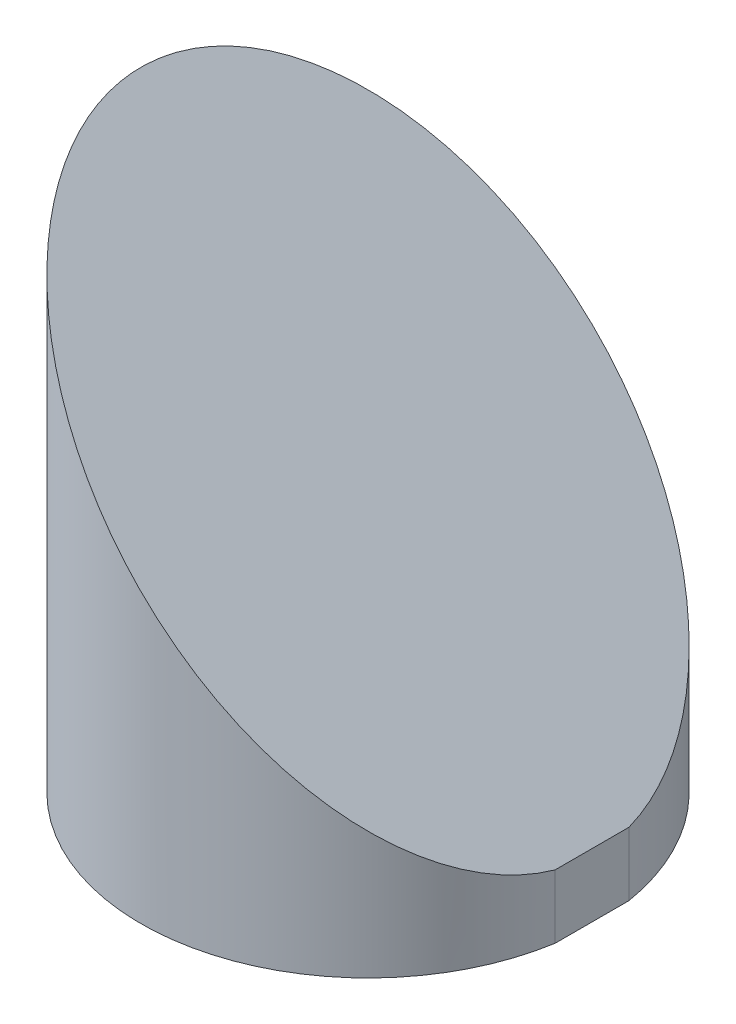
ISO-10303-21;
HEADER;
FILE_DESCRIPTION(('STEP AP214'),'2;1');
FILE_NAME('part.step','',(''),(''),'','','');
FILE_SCHEMA(('AUTOMOTIVE_DESIGN { 1 0 10303 214 1 1 1 1 }'));
ENDSEC;
DATA;
#1=APPLICATION_CONTEXT('core data for automotive mechanical design processes');
#2=APPLICATION_PROTOCOL_DEFINITION('international standard','automotive_design',2000,#1);
#3=PRODUCT_CONTEXT('',#1,'mechanical');
#4=PRODUCT('Part','Part','',(#3));
#5=PRODUCT_RELATED_PRODUCT_CATEGORY('part','',(#4));
#6=PRODUCT_DEFINITION_FORMATION('','',#4);
#7=PRODUCT_DEFINITION_CONTEXT('part definition',#1,'design');
#8=PRODUCT_DEFINITION('design','',#6,#7);
#9=PRODUCT_DEFINITION_SHAPE('','',#8);
#10=(LENGTH_UNIT() NAMED_UNIT(*) SI_UNIT(.MILLI.,.METRE.));
#11=(NAMED_UNIT(*) PLANE_ANGLE_UNIT() SI_UNIT($,.RADIAN.));
#12=(NAMED_UNIT(*) SI_UNIT($,.STERADIAN.) SOLID_ANGLE_UNIT());
#13=UNCERTAINTY_MEASURE_WITH_UNIT(LENGTH_MEASURE(1.E-05),#10,'distance_accuracy_value','');
#14=(GEOMETRIC_REPRESENTATION_CONTEXT(3) GLOBAL_UNCERTAINTY_ASSIGNED_CONTEXT((#13)) GLOBAL_UNIT_ASSIGNED_CONTEXT((#10,
#11,#12)) REPRESENTATION_CONTEXT('',''));
#15=CARTESIAN_POINT('',(0.,0.,0.));
#16=DIRECTION('',(0.,0.,1.));
#17=DIRECTION('',(1.,0.,0.));
#18=AXIS2_PLACEMENT_3D('',#15,#16,#17);
#19=CARTESIAN_POINT('',(0.,21.59,0.));
#20=DIRECTION('',(0.,-1.,0.));
#21=DIRECTION('',(0.,0.,-1.));
#22=AXIS2_PLACEMENT_3D('',#19,#20,#21);
#23=CYLINDRICAL_SURFACE('',#22,9.525);
#24=CARTESIAN_POINT('',(0.,12.065,0.));
#25=DIRECTION('',(-0.707106781186548,-0.707106781186548,0.));
#26=DIRECTION('',(0.707106781186548,-0.707106781186548,0.));
#27=AXIS2_PLACEMENT_3D('',#24,#25,#26);
#28=ELLIPSE('',#27,13.4703841816037,9.525);
#29=CARTESIAN_POINT('',(9.398,2.667,1.55023256319818));
#30=VERTEX_POINT('',#29);
#31=CARTESIAN_POINT('',(9.398,2.667,-1.55023256319817));
#32=VERTEX_POINT('',#31);
#33=EDGE_CURVE('E65',#30,#32,#28,.T.);
#34=ORIENTED_EDGE('',*,*,#33,.T.);
#35=DIRECTION('',(0.,-1.,0.));
#36=VECTOR('',#35,1.);
#37=CARTESIAN_POINT('',(9.398,21.59,-1.55023256319818));
#38=LINE('',#37,#36);
#39=CARTESIAN_POINT('',(9.398,0.,-1.55023256319818));
#40=VERTEX_POINT('',#39);
#41=EDGE_CURVE('E45',#32,#40,#38,.T.);
#42=ORIENTED_EDGE('',*,*,#41,.T.);
#43=CARTESIAN_POINT('',(0.,0.,0.));
#44=DIRECTION('',(0.,1.,0.));
#45=DIRECTION('',(0.,0.,1.));
#46=AXIS2_PLACEMENT_3D('',#43,#44,#45);
#47=CIRCLE('',#46,9.525);
#48=CARTESIAN_POINT('',(9.398,0.,1.55023256319818));
#49=VERTEX_POINT('',#48);
#50=EDGE_CURVE('E38',#40,#49,#47,.T.);
#51=ORIENTED_EDGE('',*,*,#50,.T.);
#52=DIRECTION('',(0.,-1.,0.));
#53=VECTOR('',#52,1.);
#54=CARTESIAN_POINT('',(9.398,21.59,1.55023256319818));
#55=LINE('',#54,#53);
#56=EDGE_CURVE('E52',#30,#49,#55,.T.);
#57=ORIENTED_EDGE('',*,*,#56,.F.);
#58=EDGE_LOOP('',(#34,#42,#51,#57));
#59=FACE_BOUND('',#58,.T.);
#60=ADVANCED_FACE('F31',(#59),#23,.T.);
#61=CARTESIAN_POINT('',(0.,0.,0.));
#62=DIRECTION('',(0.,1.,0.));
#63=DIRECTION('',(0.,0.,1.));
#64=AXIS2_PLACEMENT_3D('',#61,#62,#63);
#65=PLANE('',#64);
#66=ORIENTED_EDGE('',*,*,#50,.F.);
#67=DIRECTION('',(0.,0.,-1.));
#68=VECTOR('',#67,1.);
#69=CARTESIAN_POINT('',(9.398,0.,1.55023256319818));
#70=LINE('',#69,#68);
#71=EDGE_CURVE('E55',#49,#40,#70,.T.);
#72=ORIENTED_EDGE('',*,*,#71,.F.);
#73=EDGE_LOOP('',(#66,#72));
#74=FACE_BOUND('',#73,.T.);
#75=ADVANCED_FACE('F63',(#74),#65,.F.);
#76=CARTESIAN_POINT('',(-9.525,21.59,-9.525));
#77=DIRECTION('',(-0.707106781186548,-0.707106781186548,0.));
#78=DIRECTION('',(0.707106781186548,-0.707106781186548,0.));
#79=AXIS2_PLACEMENT_3D('',#76,#77,#78);
#80=PLANE('',#79);
#81=ORIENTED_EDGE('',*,*,#33,.F.);
#82=DIRECTION('',(0.,0.,-1.));
#83=VECTOR('',#82,1.);
#84=CARTESIAN_POINT('',(9.398,2.667,-9.525));
#85=LINE('',#84,#83);
#86=EDGE_CURVE('E11',#30,#32,#85,.T.);
#87=ORIENTED_EDGE('',*,*,#86,.T.);
#88=EDGE_LOOP('',(#81,#87));
#89=FACE_BOUND('',#88,.T.);
#90=ADVANCED_FACE('F69',(#89),#80,.F.);
#91=CARTESIAN_POINT('',(9.398,21.59,1.55023256319818));
#92=DIRECTION('',(-1.,0.,0.));
#93=DIRECTION('',(0.,0.,1.));
#94=AXIS2_PLACEMENT_3D('',#91,#92,#93);
#95=PLANE('',#94);
#96=ORIENTED_EDGE('',*,*,#56,.T.);
#97=ORIENTED_EDGE('',*,*,#71,.T.);
#98=ORIENTED_EDGE('',*,*,#41,.F.);
#99=ORIENTED_EDGE('',*,*,#86,.F.);
#100=EDGE_LOOP('',(#96,#97,#98,#99));
#101=FACE_BOUND('',#100,.T.);
#102=ADVANCED_FACE('F54',(#101),#95,.F.);
#103=CLOSED_SHELL('',(#60,#75,#90,#102));
#104=MANIFOLD_SOLID_BREP('B2',#103);
#105=ADVANCED_BREP_SHAPE_REPRESENTATION('',(#18,#104),#14);
#106=SHAPE_DEFINITION_REPRESENTATION(#9,#105);
ENDSEC;
END-ISO-10303-21;
